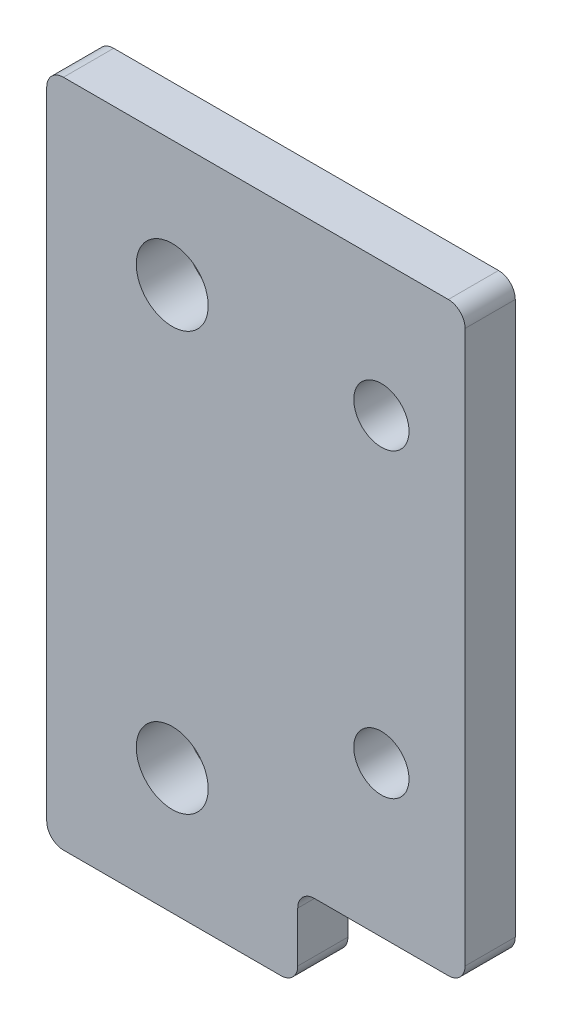
ISO-10303-21;
HEADER;
FILE_DESCRIPTION(('STEP AP214'),'2;1');
FILE_NAME('part.step','',(''),(''),'','','');
FILE_SCHEMA(('AUTOMOTIVE_DESIGN { 1 0 10303 214 1 1 1 1 }'));
ENDSEC;
DATA;
#1=APPLICATION_CONTEXT('core data for automotive mechanical design processes');
#2=APPLICATION_PROTOCOL_DEFINITION('international standard','automotive_design',2000,#1);
#3=PRODUCT_CONTEXT('',#1,'mechanical');
#4=PRODUCT('Part','Part','',(#3));
#5=PRODUCT_RELATED_PRODUCT_CATEGORY('part','',(#4));
#6=PRODUCT_DEFINITION_FORMATION('','',#4);
#7=PRODUCT_DEFINITION_CONTEXT('part definition',#1,'design');
#8=PRODUCT_DEFINITION('design','',#6,#7);
#9=PRODUCT_DEFINITION_SHAPE('','',#8);
#10=(LENGTH_UNIT() NAMED_UNIT(*) SI_UNIT(.MILLI.,.METRE.));
#11=(NAMED_UNIT(*) PLANE_ANGLE_UNIT() SI_UNIT($,.RADIAN.));
#12=(NAMED_UNIT(*) SI_UNIT($,.STERADIAN.) SOLID_ANGLE_UNIT());
#13=UNCERTAINTY_MEASURE_WITH_UNIT(LENGTH_MEASURE(1.E-05),#10,'distance_accuracy_value','');
#14=(GEOMETRIC_REPRESENTATION_CONTEXT(3) GLOBAL_UNCERTAINTY_ASSIGNED_CONTEXT((#13)) GLOBAL_UNIT_ASSIGNED_CONTEXT((#10,
#11,#12)) REPRESENTATION_CONTEXT('',''));
#15=CARTESIAN_POINT('',(0.,0.,0.));
#16=DIRECTION('',(0.,0.,1.));
#17=DIRECTION('',(1.,0.,0.));
#18=AXIS2_PLACEMENT_3D('',#15,#16,#17);
#19=CARTESIAN_POINT('',(0.,0.,3.));
#20=DIRECTION('',(0.,0.,1.));
#21=DIRECTION('',(1.,0.,0.));
#22=AXIS2_PLACEMENT_3D('',#19,#20,#21);
#23=PLANE('',#22);
#24=CARTESIAN_POINT('',(12.5,24.5,3.));
#25=DIRECTION('',(0.,0.,1.));
#26=DIRECTION('',(1.,0.,0.));
#27=AXIS2_PLACEMENT_3D('',#24,#25,#26);
#28=CIRCLE('',#27,1.65);
#29=CARTESIAN_POINT('',(14.15,24.5,3.));
#30=VERTEX_POINT('',#29);
#31=EDGE_CURVE('E254',#30,#30,#28,.T.);
#32=ORIENTED_EDGE('',*,*,#31,.F.);
#33=EDGE_LOOP('',(#32));
#34=FACE_BOUND('',#33,.T.);
#35=CARTESIAN_POINT('',(0.,0.,3.));
#36=DIRECTION('',(0.,0.,1.));
#37=DIRECTION('',(1.,0.,0.));
#38=AXIS2_PLACEMENT_3D('',#35,#36,#37);
#39=CIRCLE('',#38,2.15);
#40=CARTESIAN_POINT('',(2.15,0.,3.));
#41=VERTEX_POINT('',#40);
#42=EDGE_CURVE('E153',#41,#41,#39,.T.);
#43=ORIENTED_EDGE('',*,*,#42,.F.);
#44=EDGE_LOOP('',(#43));
#45=FACE_BOUND('',#44,.T.);
#46=DIRECTION('',(1.,0.,0.));
#47=VECTOR('',#46,1.);
#48=CARTESIAN_POINT('',(-7.5,-7.5,3.));
#49=LINE('',#48,#47);
#50=CARTESIAN_POINT('',(-6.5,-7.5,3.));
#51=VERTEX_POINT('',#50);
#52=CARTESIAN_POINT('',(6.5,-7.5,3.));
#53=VERTEX_POINT('',#52);
#54=EDGE_CURVE('E162',#51,#53,#49,.T.);
#55=ORIENTED_EDGE('',*,*,#54,.T.);
#56=CARTESIAN_POINT('',(6.5,-6.5,3.));
#57=DIRECTION('',(0.,0.,1.));
#58=DIRECTION('',(1.,0.,0.));
#59=AXIS2_PLACEMENT_3D('',#56,#57,#58);
#60=CIRCLE('',#59,1.);
#61=CARTESIAN_POINT('',(7.5,-6.5,3.));
#62=VERTEX_POINT('',#61);
#63=EDGE_CURVE('E191',#53,#62,#60,.T.);
#64=ORIENTED_EDGE('',*,*,#63,.T.);
#65=DIRECTION('',(0.,1.,0.));
#66=VECTOR('',#65,1.);
#67=CARTESIAN_POINT('',(7.5,-7.5,3.));
#68=LINE('',#67,#66);
#69=CARTESIAN_POINT('',(7.5,-3.5,3.));
#70=VERTEX_POINT('',#69);
#71=EDGE_CURVE('E145',#62,#70,#68,.T.);
#72=ORIENTED_EDGE('',*,*,#71,.T.);
#73=CARTESIAN_POINT('',(8.5,-3.5,3.));
#74=DIRECTION('',(0.,0.,1.));
#75=DIRECTION('',(1.,0.,0.));
#76=AXIS2_PLACEMENT_3D('',#73,#74,#75);
#77=CIRCLE('',#76,1.);
#78=CARTESIAN_POINT('',(8.5,-2.5,3.));
#79=VERTEX_POINT('',#78);
#80=EDGE_CURVE('E11',#70,#79,#77,.F.);
#81=ORIENTED_EDGE('',*,*,#80,.T.);
#82=DIRECTION('',(1.,0.,0.));
#83=VECTOR('',#82,1.);
#84=CARTESIAN_POINT('',(17.5,-2.5,3.));
#85=LINE('',#84,#83);
#86=CARTESIAN_POINT('',(16.5,-2.5,3.));
#87=VERTEX_POINT('',#86);
#88=EDGE_CURVE('E216',#79,#87,#85,.T.);
#89=ORIENTED_EDGE('',*,*,#88,.T.);
#90=CARTESIAN_POINT('',(16.5,-1.5,3.));
#91=DIRECTION('',(0.,0.,1.));
#92=DIRECTION('',(1.,0.,0.));
#93=AXIS2_PLACEMENT_3D('',#90,#91,#92);
#94=CIRCLE('',#93,1.);
#95=CARTESIAN_POINT('',(17.5,-1.5,3.));
#96=VERTEX_POINT('',#95);
#97=EDGE_CURVE('E184',#87,#96,#94,.T.);
#98=ORIENTED_EDGE('',*,*,#97,.T.);
#99=DIRECTION('',(0.,1.,0.));
#100=VECTOR('',#99,1.);
#101=CARTESIAN_POINT('',(17.5,32.5,3.));
#102=LINE('',#101,#100);
#103=CARTESIAN_POINT('',(17.5,31.5,3.));
#104=VERTEX_POINT('',#103);
#105=EDGE_CURVE('E225',#96,#104,#102,.T.);
#106=ORIENTED_EDGE('',*,*,#105,.T.);
#107=CARTESIAN_POINT('',(16.5,31.5,3.));
#108=DIRECTION('',(0.,0.,1.));
#109=DIRECTION('',(1.,0.,0.));
#110=AXIS2_PLACEMENT_3D('',#107,#108,#109);
#111=CIRCLE('',#110,1.);
#112=CARTESIAN_POINT('',(16.5,32.5,3.));
#113=VERTEX_POINT('',#112);
#114=EDGE_CURVE('E186',#104,#113,#111,.T.);
#115=ORIENTED_EDGE('',*,*,#114,.T.);
#116=DIRECTION('',(-1.,0.,0.));
#117=VECTOR('',#116,1.);
#118=CARTESIAN_POINT('',(7.49999999999999,32.5,3.));
#119=LINE('',#118,#117);
#120=CARTESIAN_POINT('',(-6.5,32.5,3.));
#121=VERTEX_POINT('',#120);
#122=EDGE_CURVE('E242',#113,#121,#119,.T.);
#123=ORIENTED_EDGE('',*,*,#122,.T.);
#124=CARTESIAN_POINT('',(-6.50000000000001,31.5,3.));
#125=DIRECTION('',(0.,0.,1.));
#126=DIRECTION('',(1.,0.,0.));
#127=AXIS2_PLACEMENT_3D('',#124,#125,#126);
#128=CIRCLE('',#127,1.);
#129=CARTESIAN_POINT('',(-7.50000000000001,31.5,3.));
#130=VERTEX_POINT('',#129);
#131=EDGE_CURVE('E57',#121,#130,#128,.T.);
#132=ORIENTED_EDGE('',*,*,#131,.T.);
#133=DIRECTION('',(0.,-1.,0.));
#134=VECTOR('',#133,1.);
#135=CARTESIAN_POINT('',(-7.50000000000001,32.5,3.));
#136=LINE('',#135,#134);
#137=CARTESIAN_POINT('',(-7.5,-6.50000000000001,3.));
#138=VERTEX_POINT('',#137);
#139=EDGE_CURVE('E243',#130,#138,#136,.T.);
#140=ORIENTED_EDGE('',*,*,#139,.T.);
#141=CARTESIAN_POINT('',(-6.5,-6.5,3.));
#142=DIRECTION('',(0.,0.,1.));
#143=DIRECTION('',(1.,0.,0.));
#144=AXIS2_PLACEMENT_3D('',#141,#142,#143);
#145=CIRCLE('',#144,1.);
#146=EDGE_CURVE('E189',#138,#51,#145,.T.);
#147=ORIENTED_EDGE('',*,*,#146,.T.);
#148=EDGE_LOOP('',(#55,#64,#72,#81,#89,#98,#106,#115,#123,#132,#140,#147));
#149=FACE_BOUND('',#148,.T.);
#150=CARTESIAN_POINT('',(0.,25.,3.));
#151=DIRECTION('',(0.,0.,1.));
#152=DIRECTION('',(1.,0.,0.));
#153=AXIS2_PLACEMENT_3D('',#150,#151,#152);
#154=CIRCLE('',#153,2.15);
#155=CARTESIAN_POINT('',(2.15,25.,3.));
#156=VERTEX_POINT('',#155);
#157=EDGE_CURVE('E249',#156,#156,#154,.T.);
#158=ORIENTED_EDGE('',*,*,#157,.F.);
#159=EDGE_LOOP('',(#158));
#160=FACE_BOUND('',#159,.T.);
#161=CARTESIAN_POINT('',(12.5,6.5,3.));
#162=DIRECTION('',(0.,0.,1.));
#163=DIRECTION('',(1.,0.,0.));
#164=AXIS2_PLACEMENT_3D('',#161,#162,#163);
#165=CIRCLE('',#164,1.65);
#166=CARTESIAN_POINT('',(14.15,6.5,3.));
#167=VERTEX_POINT('',#166);
#168=EDGE_CURVE('E260',#167,#167,#165,.T.);
#169=ORIENTED_EDGE('',*,*,#168,.F.);
#170=EDGE_LOOP('',(#169));
#171=FACE_BOUND('',#170,.T.);
#172=ADVANCED_FACE('F35',(#34,#45,#149,#160,#171),#23,.T.);
#173=CARTESIAN_POINT('',(0.,0.,0.));
#174=DIRECTION('',(0.,0.,1.));
#175=DIRECTION('',(1.,0.,0.));
#176=AXIS2_PLACEMENT_3D('',#173,#174,#175);
#177=PLANE('',#176);
#178=DIRECTION('',(0.,1.,0.));
#179=VECTOR('',#178,1.);
#180=CARTESIAN_POINT('',(7.5,-7.5,0.));
#181=LINE('',#180,#179);
#182=CARTESIAN_POINT('',(7.5,-6.5,0.));
#183=VERTEX_POINT('',#182);
#184=CARTESIAN_POINT('',(7.5,-3.5,0.));
#185=VERTEX_POINT('',#184);
#186=EDGE_CURVE('E142',#183,#185,#181,.T.);
#187=ORIENTED_EDGE('',*,*,#186,.F.);
#188=CARTESIAN_POINT('',(6.5,-6.5,0.));
#189=DIRECTION('',(0.,0.,1.));
#190=DIRECTION('',(1.,0.,0.));
#191=AXIS2_PLACEMENT_3D('',#188,#189,#190);
#192=CIRCLE('',#191,1.);
#193=CARTESIAN_POINT('',(6.5,-7.5,0.));
#194=VERTEX_POINT('',#193);
#195=EDGE_CURVE('E125',#183,#194,#192,.F.);
#196=ORIENTED_EDGE('',*,*,#195,.T.);
#197=DIRECTION('',(1.,0.,0.));
#198=VECTOR('',#197,1.);
#199=CARTESIAN_POINT('',(-7.5,-7.5,0.));
#200=LINE('',#199,#198);
#201=CARTESIAN_POINT('',(-6.5,-7.5,0.));
#202=VERTEX_POINT('',#201);
#203=EDGE_CURVE('E172',#202,#194,#200,.T.);
#204=ORIENTED_EDGE('',*,*,#203,.F.);
#205=CARTESIAN_POINT('',(-6.5,-6.5,0.));
#206=DIRECTION('',(0.,0.,1.));
#207=DIRECTION('',(1.,0.,0.));
#208=AXIS2_PLACEMENT_3D('',#205,#206,#207);
#209=CIRCLE('',#208,1.);
#210=CARTESIAN_POINT('',(-7.5,-6.50000000000001,0.));
#211=VERTEX_POINT('',#210);
#212=EDGE_CURVE('E136',#202,#211,#209,.F.);
#213=ORIENTED_EDGE('',*,*,#212,.T.);
#214=DIRECTION('',(0.,-1.,0.));
#215=VECTOR('',#214,1.);
#216=CARTESIAN_POINT('',(-7.50000000000001,32.5,0.));
#217=LINE('',#216,#215);
#218=CARTESIAN_POINT('',(-7.50000000000001,31.5,0.));
#219=VERTEX_POINT('',#218);
#220=EDGE_CURVE('E170',#219,#211,#217,.T.);
#221=ORIENTED_EDGE('',*,*,#220,.F.);
#222=CARTESIAN_POINT('',(-6.50000000000001,31.5,0.));
#223=DIRECTION('',(0.,0.,1.));
#224=DIRECTION('',(1.,0.,0.));
#225=AXIS2_PLACEMENT_3D('',#222,#223,#224);
#226=CIRCLE('',#225,1.);
#227=CARTESIAN_POINT('',(-6.50000000000001,32.5,0.));
#228=VERTEX_POINT('',#227);
#229=EDGE_CURVE('E178',#219,#228,#226,.F.);
#230=ORIENTED_EDGE('',*,*,#229,.T.);
#231=DIRECTION('',(-1.,0.,0.));
#232=VECTOR('',#231,1.);
#233=CARTESIAN_POINT('',(-7.50000000000001,32.5,0.));
#234=LINE('',#233,#232);
#235=CARTESIAN_POINT('',(16.5,32.5,0.));
#236=VERTEX_POINT('',#235);
#237=EDGE_CURVE('E167',#236,#228,#234,.T.);
#238=ORIENTED_EDGE('',*,*,#237,.F.);
#239=CARTESIAN_POINT('',(16.5,31.5,0.));
#240=DIRECTION('',(0.,0.,1.));
#241=DIRECTION('',(1.,0.,0.));
#242=AXIS2_PLACEMENT_3D('',#239,#240,#241);
#243=CIRCLE('',#242,1.);
#244=CARTESIAN_POINT('',(17.5,31.5,0.));
#245=VERTEX_POINT('',#244);
#246=EDGE_CURVE('E176',#236,#245,#243,.F.);
#247=ORIENTED_EDGE('',*,*,#246,.T.);
#248=DIRECTION('',(0.,1.,0.));
#249=VECTOR('',#248,1.);
#250=CARTESIAN_POINT('',(17.5,32.5,0.));
#251=LINE('',#250,#249);
#252=CARTESIAN_POINT('',(17.5,-1.5,0.));
#253=VERTEX_POINT('',#252);
#254=EDGE_CURVE('E156',#253,#245,#251,.T.);
#255=ORIENTED_EDGE('',*,*,#254,.F.);
#256=CARTESIAN_POINT('',(16.5,-1.5,0.));
#257=DIRECTION('',(0.,0.,1.));
#258=DIRECTION('',(1.,0.,0.));
#259=AXIS2_PLACEMENT_3D('',#256,#257,#258);
#260=CIRCLE('',#259,1.);
#261=CARTESIAN_POINT('',(16.5,-2.5,0.));
#262=VERTEX_POINT('',#261);
#263=EDGE_CURVE('E146',#253,#262,#260,.F.);
#264=ORIENTED_EDGE('',*,*,#263,.T.);
#265=DIRECTION('',(1.,0.,0.));
#266=VECTOR('',#265,1.);
#267=CARTESIAN_POINT('',(17.5,-2.5,0.));
#268=LINE('',#267,#266);
#269=CARTESIAN_POINT('',(8.5,-2.5,0.));
#270=VERTEX_POINT('',#269);
#271=EDGE_CURVE('E152',#270,#262,#268,.T.);
#272=ORIENTED_EDGE('',*,*,#271,.F.);
#273=CARTESIAN_POINT('',(8.5,-3.5,0.));
#274=DIRECTION('',(0.,0.,1.));
#275=DIRECTION('',(1.,0.,0.));
#276=AXIS2_PLACEMENT_3D('',#273,#274,#275);
#277=CIRCLE('',#276,1.);
#278=EDGE_CURVE('E43',#270,#185,#277,.T.);
#279=ORIENTED_EDGE('',*,*,#278,.T.);
#280=EDGE_LOOP('',(#187,#196,#204,#213,#221,#230,#238,#247,#255,#264,#272,#279));
#281=FACE_BOUND('',#280,.T.);
#282=CARTESIAN_POINT('',(0.,0.,0.));
#283=DIRECTION('',(0.,0.,1.));
#284=DIRECTION('',(1.,0.,0.));
#285=AXIS2_PLACEMENT_3D('',#282,#283,#284);
#286=CIRCLE('',#285,2.15);
#287=CARTESIAN_POINT('',(2.15,0.,0.));
#288=VERTEX_POINT('',#287);
#289=EDGE_CURVE('E159',#288,#288,#286,.T.);
#290=ORIENTED_EDGE('',*,*,#289,.T.);
#291=EDGE_LOOP('',(#290));
#292=FACE_BOUND('',#291,.T.);
#293=CARTESIAN_POINT('',(0.,25.,0.));
#294=DIRECTION('',(0.,0.,1.));
#295=DIRECTION('',(1.,0.,0.));
#296=AXIS2_PLACEMENT_3D('',#293,#294,#295);
#297=CIRCLE('',#296,2.15);
#298=CARTESIAN_POINT('',(2.15,25.,0.));
#299=VERTEX_POINT('',#298);
#300=EDGE_CURVE('E251',#299,#299,#297,.T.);
#301=ORIENTED_EDGE('',*,*,#300,.T.);
#302=EDGE_LOOP('',(#301));
#303=FACE_BOUND('',#302,.T.);
#304=CARTESIAN_POINT('',(12.5,24.5,0.));
#305=DIRECTION('',(0.,0.,1.));
#306=DIRECTION('',(1.,0.,0.));
#307=AXIS2_PLACEMENT_3D('',#304,#305,#306);
#308=CIRCLE('',#307,1.65);
#309=CARTESIAN_POINT('',(14.15,24.5,0.));
#310=VERTEX_POINT('',#309);
#311=EDGE_CURVE('E257',#310,#310,#308,.T.);
#312=ORIENTED_EDGE('',*,*,#311,.T.);
#313=EDGE_LOOP('',(#312));
#314=FACE_BOUND('',#313,.T.);
#315=CARTESIAN_POINT('',(12.5,6.5,0.));
#316=DIRECTION('',(0.,0.,1.));
#317=DIRECTION('',(1.,0.,0.));
#318=AXIS2_PLACEMENT_3D('',#315,#316,#317);
#319=CIRCLE('',#318,1.65);
#320=CARTESIAN_POINT('',(14.15,6.5,0.));
#321=VERTEX_POINT('',#320);
#322=EDGE_CURVE('E263',#321,#321,#319,.T.);
#323=ORIENTED_EDGE('',*,*,#322,.T.);
#324=EDGE_LOOP('',(#323));
#325=FACE_BOUND('',#324,.T.);
#326=ADVANCED_FACE('F149',(#281,#292,#303,#314,#325),#177,.F.);
#327=CARTESIAN_POINT('',(7.5,-7.5,3.));
#328=DIRECTION('',(-1.,0.,0.));
#329=DIRECTION('',(0.,-1.,0.));
#330=AXIS2_PLACEMENT_3D('',#327,#328,#329);
#331=PLANE('',#330);
#332=ORIENTED_EDGE('',*,*,#71,.F.);
#333=DIRECTION('',(0.,0.,-1.));
#334=VECTOR('',#333,1.);
#335=CARTESIAN_POINT('',(7.5,-6.5,3.));
#336=LINE('',#335,#334);
#337=EDGE_CURVE('E129',#62,#183,#336,.T.);
#338=ORIENTED_EDGE('',*,*,#337,.T.);
#339=ORIENTED_EDGE('',*,*,#186,.T.);
#340=DIRECTION('',(0.,0.,-1.));
#341=VECTOR('',#340,1.);
#342=CARTESIAN_POINT('',(7.5,-3.5,3.));
#343=LINE('',#342,#341);
#344=EDGE_CURVE('E147',#185,#70,#343,.F.);
#345=ORIENTED_EDGE('',*,*,#344,.T.);
#346=EDGE_LOOP('',(#332,#338,#339,#345));
#347=FACE_BOUND('',#346,.T.);
#348=ADVANCED_FACE('F141',(#347),#331,.F.);
#349=CARTESIAN_POINT('',(17.5,-2.5,3.));
#350=DIRECTION('',(0.,1.,0.));
#351=DIRECTION('',(0.,0.,1.));
#352=AXIS2_PLACEMENT_3D('',#349,#350,#351);
#353=PLANE('',#352);
#354=ORIENTED_EDGE('',*,*,#271,.T.);
#355=DIRECTION('',(0.,0.,-1.));
#356=VECTOR('',#355,1.);
#357=CARTESIAN_POINT('',(16.5,-2.5,3.));
#358=LINE('',#357,#356);
#359=EDGE_CURVE('E210',#262,#87,#358,.F.);
#360=ORIENTED_EDGE('',*,*,#359,.T.);
#361=ORIENTED_EDGE('',*,*,#88,.F.);
#362=DIRECTION('',(0.,0.,-1.));
#363=VECTOR('',#362,1.);
#364=CARTESIAN_POINT('',(8.5,-2.5,0.));
#365=LINE('',#364,#363);
#366=EDGE_CURVE('E207',#79,#270,#365,.T.);
#367=ORIENTED_EDGE('',*,*,#366,.T.);
#368=EDGE_LOOP('',(#354,#360,#361,#367));
#369=FACE_BOUND('',#368,.T.);
#370=ADVANCED_FACE('F215',(#369),#353,.F.);
#371=CARTESIAN_POINT('',(17.5,32.5,3.));
#372=DIRECTION('',(-1.,0.,0.));
#373=DIRECTION('',(0.,-1.,0.));
#374=AXIS2_PLACEMENT_3D('',#371,#372,#373);
#375=PLANE('',#374);
#376=ORIENTED_EDGE('',*,*,#254,.T.);
#377=DIRECTION('',(0.,0.,-1.));
#378=VECTOR('',#377,1.);
#379=CARTESIAN_POINT('',(17.5,31.5,3.));
#380=LINE('',#379,#378);
#381=EDGE_CURVE('E205',#245,#104,#380,.F.);
#382=ORIENTED_EDGE('',*,*,#381,.T.);
#383=ORIENTED_EDGE('',*,*,#105,.F.);
#384=DIRECTION('',(0.,0.,-1.));
#385=VECTOR('',#384,1.);
#386=CARTESIAN_POINT('',(17.5,-1.5,3.));
#387=LINE('',#386,#385);
#388=EDGE_CURVE('E202',#96,#253,#387,.T.);
#389=ORIENTED_EDGE('',*,*,#388,.T.);
#390=EDGE_LOOP('',(#376,#382,#383,#389));
#391=FACE_BOUND('',#390,.T.);
#392=ADVANCED_FACE('F231',(#391),#375,.F.);
#393=CARTESIAN_POINT('',(-7.50000000000001,32.5,3.));
#394=DIRECTION('',(0.,-1.,0.));
#395=DIRECTION('',(0.,0.,-1.));
#396=AXIS2_PLACEMENT_3D('',#393,#394,#395);
#397=PLANE('',#396);
#398=ORIENTED_EDGE('',*,*,#237,.T.);
#399=DIRECTION('',(0.,0.,-1.));
#400=VECTOR('',#399,1.);
#401=CARTESIAN_POINT('',(-6.50000000000001,32.5,3.));
#402=LINE('',#401,#400);
#403=EDGE_CURVE('E200',#228,#121,#402,.F.);
#404=ORIENTED_EDGE('',*,*,#403,.T.);
#405=ORIENTED_EDGE('',*,*,#122,.F.);
#406=DIRECTION('',(0.,0.,-1.));
#407=VECTOR('',#406,1.);
#408=CARTESIAN_POINT('',(16.5,32.5,3.));
#409=LINE('',#408,#407);
#410=EDGE_CURVE('E197',#113,#236,#409,.T.);
#411=ORIENTED_EDGE('',*,*,#410,.T.);
#412=EDGE_LOOP('',(#398,#404,#405,#411));
#413=FACE_BOUND('',#412,.T.);
#414=ADVANCED_FACE('F240',(#413),#397,.F.);
#415=CARTESIAN_POINT('',(-7.50000000000001,32.5,3.));
#416=DIRECTION('',(1.,0.,0.));
#417=DIRECTION('',(0.,1.,0.));
#418=AXIS2_PLACEMENT_3D('',#415,#416,#417);
#419=PLANE('',#418);
#420=ORIENTED_EDGE('',*,*,#220,.T.);
#421=DIRECTION('',(0.,0.,-1.));
#422=VECTOR('',#421,1.);
#423=CARTESIAN_POINT('',(-7.5,-6.50000000000001,3.));
#424=LINE('',#423,#422);
#425=EDGE_CURVE('E50',#211,#138,#424,.F.);
#426=ORIENTED_EDGE('',*,*,#425,.T.);
#427=ORIENTED_EDGE('',*,*,#139,.F.);
#428=DIRECTION('',(0.,0.,-1.));
#429=VECTOR('',#428,1.);
#430=CARTESIAN_POINT('',(-7.50000000000001,31.5,3.));
#431=LINE('',#430,#429);
#432=EDGE_CURVE('E193',#130,#219,#431,.T.);
#433=ORIENTED_EDGE('',*,*,#432,.T.);
#434=EDGE_LOOP('',(#420,#426,#427,#433));
#435=FACE_BOUND('',#434,.T.);
#436=ADVANCED_FACE('F288',(#435),#419,.F.);
#437=CARTESIAN_POINT('',(-7.5,-7.5,3.));
#438=DIRECTION('',(0.,1.,0.));
#439=DIRECTION('',(0.,0.,1.));
#440=AXIS2_PLACEMENT_3D('',#437,#438,#439);
#441=PLANE('',#440);
#442=ORIENTED_EDGE('',*,*,#203,.T.);
#443=DIRECTION('',(0.,0.,-1.));
#444=VECTOR('',#443,1.);
#445=CARTESIAN_POINT('',(6.5,-7.5,3.));
#446=LINE('',#445,#444);
#447=EDGE_CURVE('E130',#194,#53,#446,.F.);
#448=ORIENTED_EDGE('',*,*,#447,.T.);
#449=ORIENTED_EDGE('',*,*,#54,.F.);
#450=DIRECTION('',(0.,0.,-1.));
#451=VECTOR('',#450,1.);
#452=CARTESIAN_POINT('',(-6.5,-7.5,3.));
#453=LINE('',#452,#451);
#454=EDGE_CURVE('E135',#51,#202,#453,.T.);
#455=ORIENTED_EDGE('',*,*,#454,.T.);
#456=EDGE_LOOP('',(#442,#448,#449,#455));
#457=FACE_BOUND('',#456,.T.);
#458=ADVANCED_FACE('F285',(#457),#441,.F.);
#459=CARTESIAN_POINT('',(0.,0.,3.));
#460=DIRECTION('',(0.,0.,-1.));
#461=DIRECTION('',(-1.,0.,0.));
#462=AXIS2_PLACEMENT_3D('',#459,#460,#461);
#463=CYLINDRICAL_SURFACE('',#462,2.15);
#464=ORIENTED_EDGE('',*,*,#42,.T.);
#465=EDGE_LOOP('',(#464));
#466=FACE_BOUND('',#465,.T.);
#467=ORIENTED_EDGE('',*,*,#289,.F.);
#468=EDGE_LOOP('',(#467));
#469=FACE_BOUND('',#468,.T.);
#470=ADVANCED_FACE('F282',(#466,#469),#463,.F.);
#471=CARTESIAN_POINT('',(0.,25.,3.));
#472=DIRECTION('',(0.,0.,-1.));
#473=DIRECTION('',(-1.,0.,0.));
#474=AXIS2_PLACEMENT_3D('',#471,#472,#473);
#475=CYLINDRICAL_SURFACE('',#474,2.15);
#476=ORIENTED_EDGE('',*,*,#157,.T.);
#477=EDGE_LOOP('',(#476));
#478=FACE_BOUND('',#477,.T.);
#479=ORIENTED_EDGE('',*,*,#300,.F.);
#480=EDGE_LOOP('',(#479));
#481=FACE_BOUND('',#480,.T.);
#482=ADVANCED_FACE('F418',(#478,#481),#475,.F.);
#483=CARTESIAN_POINT('',(12.5,24.5,3.));
#484=DIRECTION('',(0.,0.,-1.));
#485=DIRECTION('',(-1.,0.,0.));
#486=AXIS2_PLACEMENT_3D('',#483,#484,#485);
#487=CYLINDRICAL_SURFACE('',#486,1.65);
#488=ORIENTED_EDGE('',*,*,#31,.T.);
#489=EDGE_LOOP('',(#488));
#490=FACE_BOUND('',#489,.T.);
#491=ORIENTED_EDGE('',*,*,#311,.F.);
#492=EDGE_LOOP('',(#491));
#493=FACE_BOUND('',#492,.T.);
#494=ADVANCED_FACE('F409',(#490,#493),#487,.F.);
#495=CARTESIAN_POINT('',(12.5,6.5,3.));
#496=DIRECTION('',(0.,0.,-1.));
#497=DIRECTION('',(-1.,0.,0.));
#498=AXIS2_PLACEMENT_3D('',#495,#496,#497);
#499=CYLINDRICAL_SURFACE('',#498,1.65);
#500=ORIENTED_EDGE('',*,*,#168,.T.);
#501=EDGE_LOOP('',(#500));
#502=FACE_BOUND('',#501,.T.);
#503=ORIENTED_EDGE('',*,*,#322,.F.);
#504=EDGE_LOOP('',(#503));
#505=FACE_BOUND('',#504,.T.);
#506=ADVANCED_FACE('F269',(#502,#505),#499,.F.);
#507=CARTESIAN_POINT('',(6.5,-6.5,3.));
#508=DIRECTION('',(0.,0.,-1.));
#509=DIRECTION('',(-1.,0.,0.));
#510=AXIS2_PLACEMENT_3D('',#507,#508,#509);
#511=CYLINDRICAL_SURFACE('',#510,1.);
#512=ORIENTED_EDGE('',*,*,#63,.F.);
#513=ORIENTED_EDGE('',*,*,#447,.F.);
#514=ORIENTED_EDGE('',*,*,#195,.F.);
#515=ORIENTED_EDGE('',*,*,#337,.F.);
#516=EDGE_LOOP('',(#512,#513,#514,#515));
#517=FACE_BOUND('',#516,.T.);
#518=ADVANCED_FACE('F128',(#517),#511,.T.);
#519=CARTESIAN_POINT('',(-6.5,-6.5,3.));
#520=DIRECTION('',(0.,0.,-1.));
#521=DIRECTION('',(-1.,0.,0.));
#522=AXIS2_PLACEMENT_3D('',#519,#520,#521);
#523=CYLINDRICAL_SURFACE('',#522,1.);
#524=ORIENTED_EDGE('',*,*,#146,.F.);
#525=ORIENTED_EDGE('',*,*,#425,.F.);
#526=ORIENTED_EDGE('',*,*,#212,.F.);
#527=ORIENTED_EDGE('',*,*,#454,.F.);
#528=EDGE_LOOP('',(#524,#525,#526,#527));
#529=FACE_BOUND('',#528,.T.);
#530=ADVANCED_FACE('F302',(#529),#523,.T.);
#531=CARTESIAN_POINT('',(-6.50000000000001,31.5,3.));
#532=DIRECTION('',(0.,0.,-1.));
#533=DIRECTION('',(-1.,0.,0.));
#534=AXIS2_PLACEMENT_3D('',#531,#532,#533);
#535=CYLINDRICAL_SURFACE('',#534,1.);
#536=ORIENTED_EDGE('',*,*,#131,.F.);
#537=ORIENTED_EDGE('',*,*,#403,.F.);
#538=ORIENTED_EDGE('',*,*,#229,.F.);
#539=ORIENTED_EDGE('',*,*,#432,.F.);
#540=EDGE_LOOP('',(#536,#537,#538,#539));
#541=FACE_BOUND('',#540,.T.);
#542=ADVANCED_FACE('F305',(#541),#535,.T.);
#543=CARTESIAN_POINT('',(16.5,31.5,3.));
#544=DIRECTION('',(0.,0.,-1.));
#545=DIRECTION('',(-1.,0.,0.));
#546=AXIS2_PLACEMENT_3D('',#543,#544,#545);
#547=CYLINDRICAL_SURFACE('',#546,1.);
#548=ORIENTED_EDGE('',*,*,#114,.F.);
#549=ORIENTED_EDGE('',*,*,#381,.F.);
#550=ORIENTED_EDGE('',*,*,#246,.F.);
#551=ORIENTED_EDGE('',*,*,#410,.F.);
#552=EDGE_LOOP('',(#548,#549,#550,#551));
#553=FACE_BOUND('',#552,.T.);
#554=ADVANCED_FACE('F237',(#553),#547,.T.);
#555=CARTESIAN_POINT('',(16.5,-1.5,3.));
#556=DIRECTION('',(0.,0.,-1.));
#557=DIRECTION('',(-1.,0.,0.));
#558=AXIS2_PLACEMENT_3D('',#555,#556,#557);
#559=CYLINDRICAL_SURFACE('',#558,1.);
#560=ORIENTED_EDGE('',*,*,#97,.F.);
#561=ORIENTED_EDGE('',*,*,#359,.F.);
#562=ORIENTED_EDGE('',*,*,#263,.F.);
#563=ORIENTED_EDGE('',*,*,#388,.F.);
#564=EDGE_LOOP('',(#560,#561,#562,#563));
#565=FACE_BOUND('',#564,.T.);
#566=ADVANCED_FACE('F228',(#565),#559,.T.);
#567=CARTESIAN_POINT('',(8.5,-3.5,3.));
#568=DIRECTION('',(0.,0.,1.));
#569=DIRECTION('',(1.,0.,0.));
#570=AXIS2_PLACEMENT_3D('',#567,#568,#569);
#571=CYLINDRICAL_SURFACE('',#570,1.);
#572=ORIENTED_EDGE('',*,*,#80,.F.);
#573=ORIENTED_EDGE('',*,*,#344,.F.);
#574=ORIENTED_EDGE('',*,*,#278,.F.);
#575=ORIENTED_EDGE('',*,*,#366,.F.);
#576=EDGE_LOOP('',(#572,#573,#574,#575));
#577=FACE_BOUND('',#576,.T.);
#578=ADVANCED_FACE('F37',(#577),#571,.F.);
#579=CLOSED_SHELL('',(#172,#326,#348,#370,#392,#414,#436,#458,#470,#482,#494,#506,#518,#530,
#542,#554,#566,#578));
#580=MANIFOLD_SOLID_BREP('B2',#579);
#581=ADVANCED_BREP_SHAPE_REPRESENTATION('',(#18,#580),#14);
#582=SHAPE_DEFINITION_REPRESENTATION(#9,#581);
ENDSEC;
END-ISO-10303-21;
